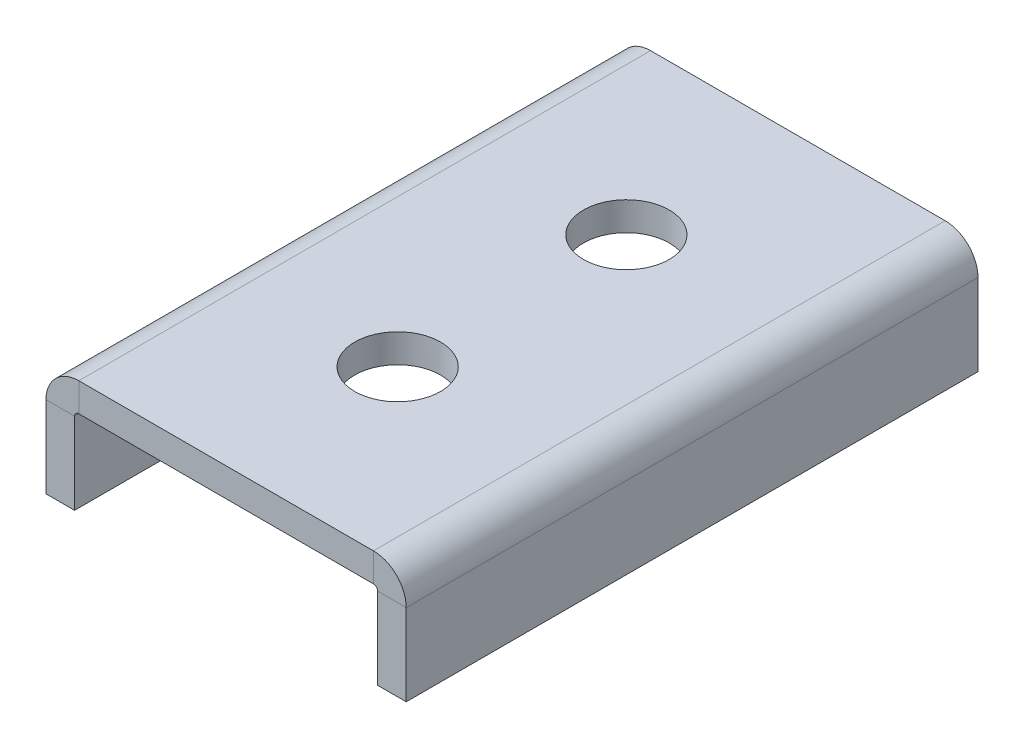
ISO-10303-21;
HEADER;
FILE_DESCRIPTION(('STEP AP214'),'2;1');
FILE_NAME('part.step','',(''),(''),'','','');
FILE_SCHEMA(('AUTOMOTIVE_DESIGN { 1 0 10303 214 1 1 1 1 }'));
ENDSEC;
DATA;
#1=APPLICATION_CONTEXT('core data for automotive mechanical design processes');
#2=APPLICATION_PROTOCOL_DEFINITION('international standard','automotive_design',2000,#1);
#3=PRODUCT_CONTEXT('',#1,'mechanical');
#4=PRODUCT('Part','Part','',(#3));
#5=PRODUCT_RELATED_PRODUCT_CATEGORY('part','',(#4));
#6=PRODUCT_DEFINITION_FORMATION('','',#4);
#7=PRODUCT_DEFINITION_CONTEXT('part definition',#1,'design');
#8=PRODUCT_DEFINITION('design','',#6,#7);
#9=PRODUCT_DEFINITION_SHAPE('','',#8);
#10=(LENGTH_UNIT() NAMED_UNIT(*) SI_UNIT(.MILLI.,.METRE.));
#11=(NAMED_UNIT(*) PLANE_ANGLE_UNIT() SI_UNIT($,.RADIAN.));
#12=(NAMED_UNIT(*) SI_UNIT($,.STERADIAN.) SOLID_ANGLE_UNIT());
#13=UNCERTAINTY_MEASURE_WITH_UNIT(LENGTH_MEASURE(1.E-05),#10,'distance_accuracy_value','');
#14=(GEOMETRIC_REPRESENTATION_CONTEXT(3) GLOBAL_UNCERTAINTY_ASSIGNED_CONTEXT((#13)) GLOBAL_UNIT_ASSIGNED_CONTEXT((#10,
#11,#12)) REPRESENTATION_CONTEXT('',''));
#15=CARTESIAN_POINT('',(0.,0.,0.));
#16=DIRECTION('',(0.,0.,1.));
#17=DIRECTION('',(1.,0.,0.));
#18=AXIS2_PLACEMENT_3D('',#15,#16,#17);
#19=CARTESIAN_POINT('',(-25.7634,0.,-100.));
#20=DIRECTION('',(0.,0.,-1.));
#21=DIRECTION('',(-1.,0.,0.));
#22=AXIS2_PLACEMENT_3D('',#19,#20,#21);
#23=PLANE('',#22);
#24=DIRECTION('',(0.,1.,0.));
#25=VECTOR('',#24,1.);
#26=CARTESIAN_POINT('',(-25.7634,0.,-100.));
#27=LINE('',#26,#25);
#28=CARTESIAN_POINT('',(-25.7634,0.,-100.));
#29=VERTEX_POINT('',#28);
#30=CARTESIAN_POINT('',(-25.7634,5.,-100.));
#31=VERTEX_POINT('',#30);
#32=EDGE_CURVE('E11',#29,#31,#27,.T.);
#33=ORIENTED_EDGE('',*,*,#32,.F.);
#34=CARTESIAN_POINT('',(-25.7634,-0.7366,-100.));
#35=DIRECTION('',(0.,0.,1.));
#36=DIRECTION('',(1.,0.,0.));
#37=AXIS2_PLACEMENT_3D('',#34,#35,#36);
#38=CIRCLE('',#37,0.7366);
#39=CARTESIAN_POINT('',(-26.5,-0.7366,-100.));
#40=VERTEX_POINT('',#39);
#41=EDGE_CURVE('E142',#40,#29,#38,.F.);
#42=ORIENTED_EDGE('',*,*,#41,.F.);
#43=DIRECTION('',(1.,0.,0.));
#44=VECTOR('',#43,1.);
#45=CARTESIAN_POINT('',(-31.5,-0.736599999999999,-100.));
#46=LINE('',#45,#44);
#47=CARTESIAN_POINT('',(-31.5,-0.736599999999999,-100.));
#48=VERTEX_POINT('',#47);
#49=EDGE_CURVE('E49',#48,#40,#46,.T.);
#50=ORIENTED_EDGE('',*,*,#49,.F.);
#51=CARTESIAN_POINT('',(-25.7634,-0.7366,-100.));
#52=DIRECTION('',(0.,0.,1.));
#53=DIRECTION('',(1.,0.,0.));
#54=AXIS2_PLACEMENT_3D('',#51,#52,#53);
#55=CIRCLE('',#54,5.7366);
#56=EDGE_CURVE('E145',#48,#31,#55,.F.);
#57=ORIENTED_EDGE('',*,*,#56,.T.);
#58=EDGE_LOOP('',(#33,#42,#50,#57));
#59=FACE_BOUND('',#58,.T.);
#60=ADVANCED_FACE('F41',(#59),#23,.T.);
#61=CARTESIAN_POINT('',(-31.5,-0.736599999999999,-100.));
#62=DIRECTION('',(0.,0.,-1.));
#63=DIRECTION('',(-1.,0.,0.));
#64=AXIS2_PLACEMENT_3D('',#61,#62,#63);
#65=PLANE('',#64);
#66=DIRECTION('',(1.,0.,0.));
#67=VECTOR('',#66,1.);
#68=CARTESIAN_POINT('',(26.5,0.,-100.));
#69=LINE('',#68,#67);
#70=CARTESIAN_POINT('',(25.7634,0.,-100.));
#71=VERTEX_POINT('',#70);
#72=EDGE_CURVE('E156',#29,#71,#69,.T.);
#73=ORIENTED_EDGE('',*,*,#72,.F.);
#74=ORIENTED_EDGE('',*,*,#32,.T.);
#75=DIRECTION('',(1.,0.,0.));
#76=VECTOR('',#75,1.);
#77=CARTESIAN_POINT('',(26.5,5.,-100.));
#78=LINE('',#77,#76);
#79=CARTESIAN_POINT('',(25.7634,5.,-100.));
#80=VERTEX_POINT('',#79);
#81=EDGE_CURVE('E262',#31,#80,#78,.T.);
#82=ORIENTED_EDGE('',*,*,#81,.T.);
#83=DIRECTION('',(0.,-1.,0.));
#84=VECTOR('',#83,1.);
#85=CARTESIAN_POINT('',(25.7634,5.,-100.));
#86=LINE('',#85,#84);
#87=EDGE_CURVE('E166',#80,#71,#86,.T.);
#88=ORIENTED_EDGE('',*,*,#87,.T.);
#89=EDGE_LOOP('',(#73,#74,#82,#88));
#90=FACE_BOUND('',#89,.T.);
#91=ADVANCED_FACE('F165',(#90),#65,.T.);
#92=CARTESIAN_POINT('',(-26.5,-0.7366,0.));
#93=DIRECTION('',(0.,0.,1.));
#94=DIRECTION('',(1.,0.,0.));
#95=AXIS2_PLACEMENT_3D('',#92,#93,#94);
#96=PLANE('',#95);
#97=DIRECTION('',(-1.,0.,0.));
#98=VECTOR('',#97,1.);
#99=CARTESIAN_POINT('',(-26.5,-0.7366,0.));
#100=LINE('',#99,#98);
#101=CARTESIAN_POINT('',(-26.5,-0.7366,0.));
#102=VERTEX_POINT('',#101);
#103=CARTESIAN_POINT('',(-31.5,-0.736599999999999,0.));
#104=VERTEX_POINT('',#103);
#105=EDGE_CURVE('E244',#102,#104,#100,.T.);
#106=ORIENTED_EDGE('',*,*,#105,.F.);
#107=CARTESIAN_POINT('',(-25.7634,-0.7366,0.));
#108=DIRECTION('',(0.,0.,1.));
#109=DIRECTION('',(1.,0.,0.));
#110=AXIS2_PLACEMENT_3D('',#107,#108,#109);
#111=CIRCLE('',#110,0.7366);
#112=CARTESIAN_POINT('',(-25.7634,0.,0.));
#113=VERTEX_POINT('',#112);
#114=EDGE_CURVE('E207',#102,#113,#111,.F.);
#115=ORIENTED_EDGE('',*,*,#114,.T.);
#116=DIRECTION('',(0.,-1.,0.));
#117=VECTOR('',#116,1.);
#118=CARTESIAN_POINT('',(-25.7634,5.,0.));
#119=LINE('',#118,#117);
#120=CARTESIAN_POINT('',(-25.7634,5.,0.));
#121=VERTEX_POINT('',#120);
#122=EDGE_CURVE('E242',#121,#113,#119,.T.);
#123=ORIENTED_EDGE('',*,*,#122,.F.);
#124=CARTESIAN_POINT('',(-25.7634,-0.7366,0.));
#125=DIRECTION('',(0.,0.,1.));
#126=DIRECTION('',(1.,0.,0.));
#127=AXIS2_PLACEMENT_3D('',#124,#125,#126);
#128=CIRCLE('',#127,5.7366);
#129=EDGE_CURVE('E196',#104,#121,#128,.F.);
#130=ORIENTED_EDGE('',*,*,#129,.F.);
#131=EDGE_LOOP('',(#106,#115,#123,#130));
#132=FACE_BOUND('',#131,.T.);
#133=ADVANCED_FACE('F325',(#132),#96,.T.);
#134=CARTESIAN_POINT('',(-25.7634,5.,0.));
#135=DIRECTION('',(0.,0.,1.));
#136=DIRECTION('',(1.,0.,0.));
#137=AXIS2_PLACEMENT_3D('',#134,#135,#136);
#138=PLANE('',#137);
#139=DIRECTION('',(0.,1.,0.));
#140=VECTOR('',#139,1.);
#141=CARTESIAN_POINT('',(-26.5,0.,0.));
#142=LINE('',#141,#140);
#143=CARTESIAN_POINT('',(-26.5,-15.,0.));
#144=VERTEX_POINT('',#143);
#145=EDGE_CURVE('E204',#144,#102,#142,.T.);
#146=ORIENTED_EDGE('',*,*,#145,.T.);
#147=ORIENTED_EDGE('',*,*,#105,.T.);
#148=DIRECTION('',(0.,1.,0.));
#149=VECTOR('',#148,1.);
#150=CARTESIAN_POINT('',(-31.5,0.,0.));
#151=LINE('',#150,#149);
#152=CARTESIAN_POINT('',(-31.5,-15.,0.));
#153=VERTEX_POINT('',#152);
#154=EDGE_CURVE('E199',#153,#104,#151,.T.);
#155=ORIENTED_EDGE('',*,*,#154,.F.);
#156=DIRECTION('',(-1.,0.,0.));
#157=VECTOR('',#156,1.);
#158=CARTESIAN_POINT('',(-26.5,-15.,0.));
#159=LINE('',#158,#157);
#160=EDGE_CURVE('E202',#144,#153,#159,.T.);
#161=ORIENTED_EDGE('',*,*,#160,.F.);
#162=EDGE_LOOP('',(#146,#147,#155,#161));
#163=FACE_BOUND('',#162,.T.);
#164=ADVANCED_FACE('F318',(#163),#138,.T.);
#165=CARTESIAN_POINT('',(26.5,-0.7366,-100.));
#166=DIRECTION('',(0.,0.,-1.));
#167=DIRECTION('',(-1.,0.,0.));
#168=AXIS2_PLACEMENT_3D('',#165,#166,#167);
#169=PLANE('',#168);
#170=DIRECTION('',(1.,0.,0.));
#171=VECTOR('',#170,1.);
#172=CARTESIAN_POINT('',(26.5,-0.7366,-100.));
#173=LINE('',#172,#171);
#174=CARTESIAN_POINT('',(26.5,-0.7366,-100.));
#175=VERTEX_POINT('',#174);
#176=CARTESIAN_POINT('',(31.5,-0.736599999999999,-100.));
#177=VERTEX_POINT('',#176);
#178=EDGE_CURVE('E57',#175,#177,#173,.T.);
#179=ORIENTED_EDGE('',*,*,#178,.F.);
#180=CARTESIAN_POINT('',(25.7634,-0.7366,-100.));
#181=DIRECTION('',(0.,0.,1.));
#182=DIRECTION('',(1.,0.,0.));
#183=AXIS2_PLACEMENT_3D('',#180,#181,#182);
#184=CIRCLE('',#183,0.7366);
#185=EDGE_CURVE('E168',#71,#175,#184,.F.);
#186=ORIENTED_EDGE('',*,*,#185,.F.);
#187=ORIENTED_EDGE('',*,*,#87,.F.);
#188=CARTESIAN_POINT('',(25.7634,-0.7366,-100.));
#189=DIRECTION('',(0.,0.,1.));
#190=DIRECTION('',(1.,0.,0.));
#191=AXIS2_PLACEMENT_3D('',#188,#189,#190);
#192=CIRCLE('',#191,5.7366);
#193=EDGE_CURVE('E264',#80,#177,#192,.F.);
#194=ORIENTED_EDGE('',*,*,#193,.T.);
#195=EDGE_LOOP('',(#179,#186,#187,#194));
#196=FACE_BOUND('',#195,.T.);
#197=ADVANCED_FACE('F316',(#196),#169,.T.);
#198=CARTESIAN_POINT('',(25.7634,5.,-100.));
#199=DIRECTION('',(0.,0.,-1.));
#200=DIRECTION('',(-1.,0.,0.));
#201=AXIS2_PLACEMENT_3D('',#198,#199,#200);
#202=PLANE('',#201);
#203=DIRECTION('',(0.,-1.,0.));
#204=VECTOR('',#203,1.);
#205=CARTESIAN_POINT('',(26.5,0.,-100.));
#206=LINE('',#205,#204);
#207=CARTESIAN_POINT('',(26.5,-15.,-100.));
#208=VERTEX_POINT('',#207);
#209=EDGE_CURVE('E212',#175,#208,#206,.T.);
#210=ORIENTED_EDGE('',*,*,#209,.F.);
#211=ORIENTED_EDGE('',*,*,#178,.T.);
#212=DIRECTION('',(0.,-1.,0.));
#213=VECTOR('',#212,1.);
#214=CARTESIAN_POINT('',(31.5,0.,-100.));
#215=LINE('',#214,#213);
#216=CARTESIAN_POINT('',(31.5,-15.,-100.));
#217=VERTEX_POINT('',#216);
#218=EDGE_CURVE('E268',#177,#217,#215,.T.);
#219=ORIENTED_EDGE('',*,*,#218,.T.);
#220=DIRECTION('',(-1.,0.,0.));
#221=VECTOR('',#220,1.);
#222=CARTESIAN_POINT('',(31.5,-15.,-100.));
#223=LINE('',#222,#221);
#224=EDGE_CURVE('E114',#217,#208,#223,.T.);
#225=ORIENTED_EDGE('',*,*,#224,.T.);
#226=EDGE_LOOP('',(#210,#211,#219,#225));
#227=FACE_BOUND('',#226,.T.);
#228=ADVANCED_FACE('F315',(#227),#202,.T.);
#229=CARTESIAN_POINT('',(25.7634,0.,0.));
#230=DIRECTION('',(0.,0.,1.));
#231=DIRECTION('',(1.,0.,0.));
#232=AXIS2_PLACEMENT_3D('',#229,#230,#231);
#233=PLANE('',#232);
#234=DIRECTION('',(0.,1.,0.));
#235=VECTOR('',#234,1.);
#236=CARTESIAN_POINT('',(25.7634,0.,0.));
#237=LINE('',#236,#235);
#238=CARTESIAN_POINT('',(25.7634,0.,0.));
#239=VERTEX_POINT('',#238);
#240=CARTESIAN_POINT('',(25.7634,5.,0.));
#241=VERTEX_POINT('',#240);
#242=EDGE_CURVE('E98',#239,#241,#237,.T.);
#243=ORIENTED_EDGE('',*,*,#242,.F.);
#244=CARTESIAN_POINT('',(25.7634,-0.7366,0.));
#245=DIRECTION('',(0.,0.,1.));
#246=DIRECTION('',(1.,0.,0.));
#247=AXIS2_PLACEMENT_3D('',#244,#245,#246);
#248=CIRCLE('',#247,0.7366);
#249=CARTESIAN_POINT('',(26.5,-0.7366,0.));
#250=VERTEX_POINT('',#249);
#251=EDGE_CURVE('E210',#239,#250,#248,.F.);
#252=ORIENTED_EDGE('',*,*,#251,.T.);
#253=DIRECTION('',(-1.,0.,0.));
#254=VECTOR('',#253,1.);
#255=CARTESIAN_POINT('',(31.5,-0.736599999999999,0.));
#256=LINE('',#255,#254);
#257=CARTESIAN_POINT('',(31.5,-0.736599999999999,0.));
#258=VERTEX_POINT('',#257);
#259=EDGE_CURVE('E105',#258,#250,#256,.T.);
#260=ORIENTED_EDGE('',*,*,#259,.F.);
#261=CARTESIAN_POINT('',(25.7634,-0.7366,0.));
#262=DIRECTION('',(0.,0.,1.));
#263=DIRECTION('',(1.,0.,0.));
#264=AXIS2_PLACEMENT_3D('',#261,#262,#263);
#265=CIRCLE('',#264,5.7366);
#266=EDGE_CURVE('E190',#241,#258,#265,.F.);
#267=ORIENTED_EDGE('',*,*,#266,.F.);
#268=EDGE_LOOP('',(#243,#252,#260,#267));
#269=FACE_BOUND('',#268,.T.);
#270=ADVANCED_FACE('F300',(#269),#233,.T.);
#271=CARTESIAN_POINT('',(31.5,-0.736599999999999,0.));
#272=DIRECTION('',(0.,0.,1.));
#273=DIRECTION('',(1.,0.,0.));
#274=AXIS2_PLACEMENT_3D('',#271,#272,#273);
#275=PLANE('',#274);
#276=DIRECTION('',(1.,0.,0.));
#277=VECTOR('',#276,1.);
#278=CARTESIAN_POINT('',(26.5,0.,0.));
#279=LINE('',#278,#277);
#280=EDGE_CURVE('E158',#113,#239,#279,.T.);
#281=ORIENTED_EDGE('',*,*,#280,.T.);
#282=ORIENTED_EDGE('',*,*,#242,.T.);
#283=DIRECTION('',(1.,0.,0.));
#284=VECTOR('',#283,1.);
#285=CARTESIAN_POINT('',(26.5,5.,0.));
#286=LINE('',#285,#284);
#287=EDGE_CURVE('E193',#121,#241,#286,.T.);
#288=ORIENTED_EDGE('',*,*,#287,.F.);
#289=ORIENTED_EDGE('',*,*,#122,.T.);
#290=EDGE_LOOP('',(#281,#282,#288,#289));
#291=FACE_BOUND('',#290,.T.);
#292=ADVANCED_FACE('F365',(#291),#275,.T.);
#293=CARTESIAN_POINT('',(26.5,0.,-100.));
#294=DIRECTION('',(-1.,0.,0.));
#295=DIRECTION('',(0.,-1.,0.));
#296=AXIS2_PLACEMENT_3D('',#293,#294,#295);
#297=PLANE('',#296);
#298=DIRECTION('',(0.,-1.,0.));
#299=VECTOR('',#298,1.);
#300=CARTESIAN_POINT('',(26.5,0.,0.));
#301=LINE('',#300,#299);
#302=CARTESIAN_POINT('',(26.5,-15.,0.));
#303=VERTEX_POINT('',#302);
#304=EDGE_CURVE('E182',#250,#303,#301,.T.);
#305=ORIENTED_EDGE('',*,*,#304,.F.);
#306=DIRECTION('',(0.,0.,1.));
#307=VECTOR('',#306,1.);
#308=CARTESIAN_POINT('',(26.5,-0.7366,-100.));
#309=LINE('',#308,#307);
#310=EDGE_CURVE('E213',#175,#250,#309,.T.);
#311=ORIENTED_EDGE('',*,*,#310,.F.);
#312=ORIENTED_EDGE('',*,*,#209,.T.);
#313=DIRECTION('',(0.,0.,1.));
#314=VECTOR('',#313,1.);
#315=CARTESIAN_POINT('',(26.5,-15.,-100.));
#316=LINE('',#315,#314);
#317=EDGE_CURVE('E181',#208,#303,#316,.T.);
#318=ORIENTED_EDGE('',*,*,#317,.T.);
#319=EDGE_LOOP('',(#305,#311,#312,#318));
#320=FACE_BOUND('',#319,.T.);
#321=ADVANCED_FACE('F306',(#320),#297,.T.);
#322=CARTESIAN_POINT('',(25.7634,-0.7366,-100.));
#323=DIRECTION('',(0.,0.,1.));
#324=DIRECTION('',(1.,0.,0.));
#325=AXIS2_PLACEMENT_3D('',#322,#323,#324);
#326=CYLINDRICAL_SURFACE('',#325,0.7366);
#327=ORIENTED_EDGE('',*,*,#251,.F.);
#328=DIRECTION('',(0.,0.,1.));
#329=VECTOR('',#328,1.);
#330=CARTESIAN_POINT('',(25.7634,0.,-100.));
#331=LINE('',#330,#329);
#332=EDGE_CURVE('E162',#71,#239,#331,.T.);
#333=ORIENTED_EDGE('',*,*,#332,.F.);
#334=ORIENTED_EDGE('',*,*,#185,.T.);
#335=ORIENTED_EDGE('',*,*,#310,.T.);
#336=EDGE_LOOP('',(#327,#333,#334,#335));
#337=FACE_BOUND('',#336,.T.);
#338=ADVANCED_FACE('F303',(#337),#326,.F.);
#339=CARTESIAN_POINT('',(26.5,0.,-100.));
#340=DIRECTION('',(0.,-1.,0.));
#341=DIRECTION('',(0.,0.,-1.));
#342=AXIS2_PLACEMENT_3D('',#339,#340,#341);
#343=PLANE('',#342);
#344=CARTESIAN_POINT('',(0.,0.,-70.));
#345=DIRECTION('',(0.,-1.,0.));
#346=DIRECTION('',(0.,0.,-1.));
#347=AXIS2_PLACEMENT_3D('',#344,#345,#346);
#348=CIRCLE('',#347,7.5);
#349=CARTESIAN_POINT('',(0.,0.,-77.5));
#350=VERTEX_POINT('',#349);
#351=EDGE_CURVE('E278',#350,#350,#348,.T.);
#352=ORIENTED_EDGE('',*,*,#351,.F.);
#353=EDGE_LOOP('',(#352));
#354=FACE_BOUND('',#353,.T.);
#355=CARTESIAN_POINT('',(0.,0.,-30.));
#356=DIRECTION('',(0.,-1.,0.));
#357=DIRECTION('',(0.,0.,-1.));
#358=AXIS2_PLACEMENT_3D('',#355,#356,#357);
#359=CIRCLE('',#358,7.5);
#360=CARTESIAN_POINT('',(0.,0.,-37.5));
#361=VERTEX_POINT('',#360);
#362=EDGE_CURVE('E185',#361,#361,#359,.T.);
#363=ORIENTED_EDGE('',*,*,#362,.F.);
#364=EDGE_LOOP('',(#363));
#365=FACE_BOUND('',#364,.T.);
#366=ORIENTED_EDGE('',*,*,#280,.F.);
#367=DIRECTION('',(0.,0.,1.));
#368=VECTOR('',#367,1.);
#369=CARTESIAN_POINT('',(-25.7634,0.,-100.));
#370=LINE('',#369,#368);
#371=EDGE_CURVE('E154',#29,#113,#370,.T.);
#372=ORIENTED_EDGE('',*,*,#371,.F.);
#373=ORIENTED_EDGE('',*,*,#72,.T.);
#374=ORIENTED_EDGE('',*,*,#332,.T.);
#375=EDGE_LOOP('',(#366,#372,#373,#374));
#376=FACE_BOUND('',#375,.T.);
#377=ADVANCED_FACE('F155',(#354,#365,#376),#343,.T.);
#378=CARTESIAN_POINT('',(-25.7634,-0.7366,-100.));
#379=DIRECTION('',(0.,0.,1.));
#380=DIRECTION('',(1.,0.,0.));
#381=AXIS2_PLACEMENT_3D('',#378,#379,#380);
#382=CYLINDRICAL_SURFACE('',#381,0.7366);
#383=ORIENTED_EDGE('',*,*,#114,.F.);
#384=DIRECTION('',(0.,0.,1.));
#385=VECTOR('',#384,1.);
#386=CARTESIAN_POINT('',(-26.5,-0.7366,-100.));
#387=LINE('',#386,#385);
#388=EDGE_CURVE('E163',#40,#102,#387,.T.);
#389=ORIENTED_EDGE('',*,*,#388,.F.);
#390=ORIENTED_EDGE('',*,*,#41,.T.);
#391=ORIENTED_EDGE('',*,*,#371,.T.);
#392=EDGE_LOOP('',(#383,#389,#390,#391));
#393=FACE_BOUND('',#392,.T.);
#394=ADVANCED_FACE('F171',(#393),#382,.F.);
#395=CARTESIAN_POINT('',(-26.5,0.,-100.));
#396=DIRECTION('',(1.,0.,0.));
#397=DIRECTION('',(0.,0.,-1.));
#398=AXIS2_PLACEMENT_3D('',#395,#396,#397);
#399=PLANE('',#398);
#400=ORIENTED_EDGE('',*,*,#145,.F.);
#401=DIRECTION('',(0.,0.,1.));
#402=VECTOR('',#401,1.);
#403=CARTESIAN_POINT('',(-26.5,-15.,-100.));
#404=LINE('',#403,#402);
#405=CARTESIAN_POINT('',(-26.5,-15.,-100.));
#406=VERTEX_POINT('',#405);
#407=EDGE_CURVE('E217',#406,#144,#404,.T.);
#408=ORIENTED_EDGE('',*,*,#407,.F.);
#409=DIRECTION('',(0.,1.,0.));
#410=VECTOR('',#409,1.);
#411=CARTESIAN_POINT('',(-26.5,0.,-100.));
#412=LINE('',#411,#410);
#413=EDGE_CURVE('E173',#406,#40,#412,.T.);
#414=ORIENTED_EDGE('',*,*,#413,.T.);
#415=ORIENTED_EDGE('',*,*,#388,.T.);
#416=EDGE_LOOP('',(#400,#408,#414,#415));
#417=FACE_BOUND('',#416,.T.);
#418=ADVANCED_FACE('F341',(#417),#399,.T.);
#419=CARTESIAN_POINT('',(-26.5,-15.,-100.));
#420=DIRECTION('',(0.,1.,0.));
#421=DIRECTION('',(0.,0.,1.));
#422=AXIS2_PLACEMENT_3D('',#419,#420,#421);
#423=PLANE('',#422);
#424=ORIENTED_EDGE('',*,*,#160,.T.);
#425=DIRECTION('',(0.,0.,1.));
#426=VECTOR('',#425,1.);
#427=CARTESIAN_POINT('',(-31.5,-15.,-100.));
#428=LINE('',#427,#426);
#429=CARTESIAN_POINT('',(-31.5,-15.,-100.));
#430=VERTEX_POINT('',#429);
#431=EDGE_CURVE('E219',#430,#153,#428,.T.);
#432=ORIENTED_EDGE('',*,*,#431,.F.);
#433=DIRECTION('',(-1.,0.,0.));
#434=VECTOR('',#433,1.);
#435=CARTESIAN_POINT('',(-26.5,-15.,-100.));
#436=LINE('',#435,#434);
#437=EDGE_CURVE('E175',#406,#430,#436,.T.);
#438=ORIENTED_EDGE('',*,*,#437,.F.);
#439=ORIENTED_EDGE('',*,*,#407,.T.);
#440=EDGE_LOOP('',(#424,#432,#438,#439));
#441=FACE_BOUND('',#440,.T.);
#442=ADVANCED_FACE('F344',(#441),#423,.F.);
#443=CARTESIAN_POINT('',(-31.5,0.,-100.));
#444=DIRECTION('',(1.,0.,0.));
#445=DIRECTION('',(0.,0.,-1.));
#446=AXIS2_PLACEMENT_3D('',#443,#444,#445);
#447=PLANE('',#446);
#448=ORIENTED_EDGE('',*,*,#154,.T.);
#449=DIRECTION('',(0.,0.,1.));
#450=VECTOR('',#449,1.);
#451=CARTESIAN_POINT('',(-31.5,-0.736599999999999,-100.));
#452=LINE('',#451,#450);
#453=EDGE_CURVE('E222',#48,#104,#452,.T.);
#454=ORIENTED_EDGE('',*,*,#453,.F.);
#455=DIRECTION('',(0.,1.,0.));
#456=VECTOR('',#455,1.);
#457=CARTESIAN_POINT('',(-31.5,0.,-100.));
#458=LINE('',#457,#456);
#459=EDGE_CURVE('E250',#430,#48,#458,.T.);
#460=ORIENTED_EDGE('',*,*,#459,.F.);
#461=ORIENTED_EDGE('',*,*,#431,.T.);
#462=EDGE_LOOP('',(#448,#454,#460,#461));
#463=FACE_BOUND('',#462,.T.);
#464=ADVANCED_FACE('F256',(#463),#447,.F.);
#465=CARTESIAN_POINT('',(-25.7634,-0.7366,-100.));
#466=DIRECTION('',(0.,0.,1.));
#467=DIRECTION('',(1.,0.,0.));
#468=AXIS2_PLACEMENT_3D('',#465,#466,#467);
#469=CYLINDRICAL_SURFACE('',#468,5.7366);
#470=ORIENTED_EDGE('',*,*,#129,.T.);
#471=DIRECTION('',(0.,0.,1.));
#472=VECTOR('',#471,1.);
#473=CARTESIAN_POINT('',(-25.7634,5.,-100.));
#474=LINE('',#473,#472);
#475=EDGE_CURVE('E225',#31,#121,#474,.T.);
#476=ORIENTED_EDGE('',*,*,#475,.F.);
#477=ORIENTED_EDGE('',*,*,#56,.F.);
#478=ORIENTED_EDGE('',*,*,#453,.T.);
#479=EDGE_LOOP('',(#470,#476,#477,#478));
#480=FACE_BOUND('',#479,.T.);
#481=ADVANCED_FACE('F260',(#480),#469,.T.);
#482=CARTESIAN_POINT('',(26.5,5.,-100.));
#483=DIRECTION('',(0.,-1.,0.));
#484=DIRECTION('',(0.,0.,-1.));
#485=AXIS2_PLACEMENT_3D('',#482,#483,#484);
#486=PLANE('',#485);
#487=CARTESIAN_POINT('',(0.,5.,-70.));
#488=DIRECTION('',(0.,1.,0.));
#489=DIRECTION('',(0.,0.,1.));
#490=AXIS2_PLACEMENT_3D('',#487,#488,#489);
#491=CIRCLE('',#490,7.5);
#492=CARTESIAN_POINT('',(0.,5.,-62.5));
#493=VERTEX_POINT('',#492);
#494=EDGE_CURVE('E281',#493,#493,#491,.T.);
#495=ORIENTED_EDGE('',*,*,#494,.F.);
#496=EDGE_LOOP('',(#495));
#497=FACE_BOUND('',#496,.T.);
#498=CARTESIAN_POINT('',(0.,5.,-30.));
#499=DIRECTION('',(0.,1.,0.));
#500=DIRECTION('',(0.,0.,1.));
#501=AXIS2_PLACEMENT_3D('',#498,#499,#500);
#502=CIRCLE('',#501,7.5);
#503=CARTESIAN_POINT('',(0.,5.,-22.5));
#504=VERTEX_POINT('',#503);
#505=EDGE_CURVE('E275',#504,#504,#502,.T.);
#506=ORIENTED_EDGE('',*,*,#505,.F.);
#507=EDGE_LOOP('',(#506));
#508=FACE_BOUND('',#507,.T.);
#509=ORIENTED_EDGE('',*,*,#287,.T.);
#510=DIRECTION('',(0.,0.,1.));
#511=VECTOR('',#510,1.);
#512=CARTESIAN_POINT('',(25.7634,5.,-100.));
#513=LINE('',#512,#511);
#514=EDGE_CURVE('E228',#80,#241,#513,.T.);
#515=ORIENTED_EDGE('',*,*,#514,.F.);
#516=ORIENTED_EDGE('',*,*,#81,.F.);
#517=ORIENTED_EDGE('',*,*,#475,.T.);
#518=EDGE_LOOP('',(#509,#515,#516,#517));
#519=FACE_BOUND('',#518,.T.);
#520=ADVANCED_FACE('F287',(#497,#508,#519),#486,.F.);
#521=CARTESIAN_POINT('',(25.7634,-0.7366,-100.));
#522=DIRECTION('',(0.,0.,1.));
#523=DIRECTION('',(1.,0.,0.));
#524=AXIS2_PLACEMENT_3D('',#521,#522,#523);
#525=CYLINDRICAL_SURFACE('',#524,5.7366);
#526=ORIENTED_EDGE('',*,*,#266,.T.);
#527=DIRECTION('',(0.,0.,1.));
#528=VECTOR('',#527,1.);
#529=CARTESIAN_POINT('',(31.5,-0.736599999999999,-100.));
#530=LINE('',#529,#528);
#531=EDGE_CURVE('E231',#177,#258,#530,.T.);
#532=ORIENTED_EDGE('',*,*,#531,.F.);
#533=ORIENTED_EDGE('',*,*,#193,.F.);
#534=ORIENTED_EDGE('',*,*,#514,.T.);
#535=EDGE_LOOP('',(#526,#532,#533,#534));
#536=FACE_BOUND('',#535,.T.);
#537=ADVANCED_FACE('F290',(#536),#525,.T.);
#538=CARTESIAN_POINT('',(31.5,0.,-100.));
#539=DIRECTION('',(-1.,0.,0.));
#540=DIRECTION('',(0.,-1.,0.));
#541=AXIS2_PLACEMENT_3D('',#538,#539,#540);
#542=PLANE('',#541);
#543=DIRECTION('',(0.,-1.,0.));
#544=VECTOR('',#543,1.);
#545=CARTESIAN_POINT('',(31.5,0.,0.));
#546=LINE('',#545,#544);
#547=CARTESIAN_POINT('',(31.5,-15.,0.));
#548=VERTEX_POINT('',#547);
#549=EDGE_CURVE('E188',#258,#548,#546,.T.);
#550=ORIENTED_EDGE('',*,*,#549,.T.);
#551=DIRECTION('',(0.,0.,1.));
#552=VECTOR('',#551,1.);
#553=CARTESIAN_POINT('',(31.5,-15.,-100.));
#554=LINE('',#553,#552);
#555=EDGE_CURVE('E234',#217,#548,#554,.T.);
#556=ORIENTED_EDGE('',*,*,#555,.F.);
#557=ORIENTED_EDGE('',*,*,#218,.F.);
#558=ORIENTED_EDGE('',*,*,#531,.T.);
#559=EDGE_LOOP('',(#550,#556,#557,#558));
#560=FACE_BOUND('',#559,.T.);
#561=ADVANCED_FACE('F314',(#560),#542,.F.);
#562=CARTESIAN_POINT('',(31.5,-15.,-100.));
#563=DIRECTION('',(0.,1.,0.));
#564=DIRECTION('',(-1.,0.,0.));
#565=AXIS2_PLACEMENT_3D('',#562,#563,#564);
#566=PLANE('',#565);
#567=DIRECTION('',(-1.,0.,0.));
#568=VECTOR('',#567,1.);
#569=CARTESIAN_POINT('',(31.5,-15.,0.));
#570=LINE('',#569,#568);
#571=EDGE_CURVE('E184',#548,#303,#570,.T.);
#572=ORIENTED_EDGE('',*,*,#571,.T.);
#573=ORIENTED_EDGE('',*,*,#317,.F.);
#574=ORIENTED_EDGE('',*,*,#224,.F.);
#575=ORIENTED_EDGE('',*,*,#555,.T.);
#576=EDGE_LOOP('',(#572,#573,#574,#575));
#577=FACE_BOUND('',#576,.T.);
#578=ADVANCED_FACE('F310',(#577),#566,.F.);
#579=CARTESIAN_POINT('',(25.7634,-0.7366,-100.));
#580=DIRECTION('',(0.,0.,1.));
#581=DIRECTION('',(1.,0.,0.));
#582=AXIS2_PLACEMENT_3D('',#579,#580,#581);
#583=PLANE('',#582);
#584=ORIENTED_EDGE('',*,*,#459,.T.);
#585=ORIENTED_EDGE('',*,*,#49,.T.);
#586=ORIENTED_EDGE('',*,*,#413,.F.);
#587=ORIENTED_EDGE('',*,*,#437,.T.);
#588=EDGE_LOOP('',(#584,#585,#586,#587));
#589=FACE_BOUND('',#588,.T.);
#590=ADVANCED_FACE('F248',(#589),#583,.F.);
#591=CARTESIAN_POINT('',(25.7634,-0.7366,0.));
#592=DIRECTION('',(0.,0.,1.));
#593=DIRECTION('',(1.,0.,0.));
#594=AXIS2_PLACEMENT_3D('',#591,#592,#593);
#595=PLANE('',#594);
#596=ORIENTED_EDGE('',*,*,#304,.T.);
#597=ORIENTED_EDGE('',*,*,#571,.F.);
#598=ORIENTED_EDGE('',*,*,#549,.F.);
#599=ORIENTED_EDGE('',*,*,#259,.T.);
#600=EDGE_LOOP('',(#596,#597,#598,#599));
#601=FACE_BOUND('',#600,.T.);
#602=ADVANCED_FACE('F308',(#601),#595,.T.);
#603=CARTESIAN_POINT('',(0.,5.,-30.));
#604=DIRECTION('',(0.,1.,0.));
#605=DIRECTION('',(0.,0.,1.));
#606=AXIS2_PLACEMENT_3D('',#603,#604,#605);
#607=CYLINDRICAL_SURFACE('',#606,7.5);
#608=ORIENTED_EDGE('',*,*,#362,.T.);
#609=EDGE_LOOP('',(#608));
#610=FACE_BOUND('',#609,.T.);
#611=ORIENTED_EDGE('',*,*,#505,.T.);
#612=EDGE_LOOP('',(#611));
#613=FACE_BOUND('',#612,.T.);
#614=ADVANCED_FACE('F463',(#610,#613),#607,.F.);
#615=CARTESIAN_POINT('',(0.,5.,-70.));
#616=DIRECTION('',(0.,1.,0.));
#617=DIRECTION('',(0.,0.,1.));
#618=AXIS2_PLACEMENT_3D('',#615,#616,#617);
#619=CYLINDRICAL_SURFACE('',#618,7.5);
#620=ORIENTED_EDGE('',*,*,#351,.T.);
#621=EDGE_LOOP('',(#620));
#622=FACE_BOUND('',#621,.T.);
#623=ORIENTED_EDGE('',*,*,#494,.T.);
#624=EDGE_LOOP('',(#623));
#625=FACE_BOUND('',#624,.T.);
#626=ADVANCED_FACE('F285',(#622,#625),#619,.F.);
#627=CLOSED_SHELL('',(#60,#91,#133,#164,#197,#228,#270,#292,#321,#338,#377,#394,#418,#442,#464,
#481,#520,#537,#561,#578,#590,#602,#614,#626));
#628=MANIFOLD_SOLID_BREP('B2',#627);
#629=ADVANCED_BREP_SHAPE_REPRESENTATION('',(#18,#628),#14);
#630=SHAPE_DEFINITION_REPRESENTATION(#9,#629);
ENDSEC;
END-ISO-10303-21;
